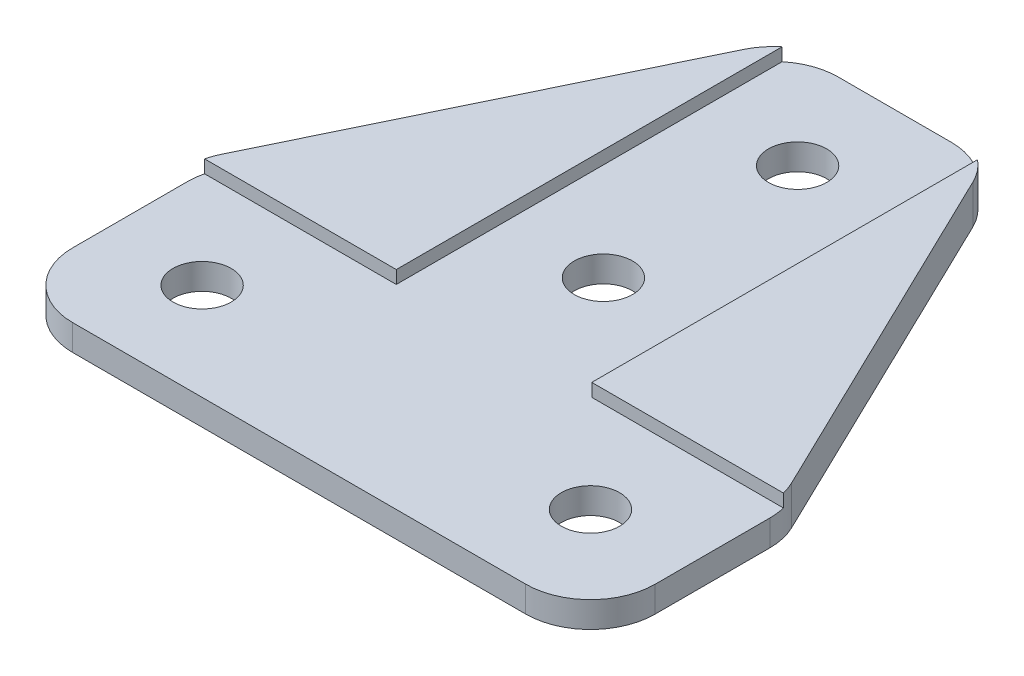
ISO-10303-21;
HEADER;
FILE_DESCRIPTION(('STEP AP214'),'2;1');
FILE_NAME('part.step','',(''),(''),'','','');
FILE_SCHEMA(('AUTOMOTIVE_DESIGN { 1 0 10303 214 1 1 1 1 }'));
ENDSEC;
DATA;
#1=APPLICATION_CONTEXT('core data for automotive mechanical design processes');
#2=APPLICATION_PROTOCOL_DEFINITION('international standard','automotive_design',2000,#1);
#3=PRODUCT_CONTEXT('',#1,'mechanical');
#4=PRODUCT('Part','Part','',(#3));
#5=PRODUCT_RELATED_PRODUCT_CATEGORY('part','',(#4));
#6=PRODUCT_DEFINITION_FORMATION('','',#4);
#7=PRODUCT_DEFINITION_CONTEXT('part definition',#1,'design');
#8=PRODUCT_DEFINITION('design','',#6,#7);
#9=PRODUCT_DEFINITION_SHAPE('','',#8);
#10=(LENGTH_UNIT() NAMED_UNIT(*) SI_UNIT(.MILLI.,.METRE.));
#11=(NAMED_UNIT(*) PLANE_ANGLE_UNIT() SI_UNIT($,.RADIAN.));
#12=(NAMED_UNIT(*) SI_UNIT($,.STERADIAN.) SOLID_ANGLE_UNIT());
#13=UNCERTAINTY_MEASURE_WITH_UNIT(LENGTH_MEASURE(1.E-05),#10,'distance_accuracy_value','');
#14=(GEOMETRIC_REPRESENTATION_CONTEXT(3) GLOBAL_UNCERTAINTY_ASSIGNED_CONTEXT((#13)) GLOBAL_UNIT_ASSIGNED_CONTEXT((#10,
#11,#12)) REPRESENTATION_CONTEXT('',''));
#15=CARTESIAN_POINT('',(0.,0.,0.));
#16=DIRECTION('',(0.,0.,1.));
#17=DIRECTION('',(1.,0.,0.));
#18=AXIS2_PLACEMENT_3D('',#15,#16,#17);
#19=CARTESIAN_POINT('',(0.,3.,-15.));
#20=DIRECTION('',(1.,0.,0.));
#21=DIRECTION('',(0.,0.,-1.));
#22=AXIS2_PLACEMENT_3D('',#19,#20,#21);
#23=PLANE('',#22);
#24=DIRECTION('',(0.,0.,1.));
#25=VECTOR('',#24,1.);
#26=CARTESIAN_POINT('',(0.,2.,0.));
#27=LINE('',#26,#25);
#28=CARTESIAN_POINT('',(0.,2.,-13.8538830948516));
#29=VERTEX_POINT('',#28);
#30=CARTESIAN_POINT('',(0.,2.,-5.));
#31=VERTEX_POINT('',#30);
#32=EDGE_CURVE('E54',#29,#31,#27,.T.);
#33=ORIENTED_EDGE('',*,*,#32,.F.);
#34=DIRECTION('',(0.,-1.,0.));
#35=VECTOR('',#34,1.);
#36=CARTESIAN_POINT('',(0.,3.,-13.8538830948516));
#37=LINE('',#36,#35);
#38=CARTESIAN_POINT('',(0.,0.,-13.8538830948516));
#39=VERTEX_POINT('',#38);
#40=EDGE_CURVE('E318',#29,#39,#37,.T.);
#41=ORIENTED_EDGE('',*,*,#40,.T.);
#42=DIRECTION('',(0.,0.,1.));
#43=VECTOR('',#42,1.);
#44=CARTESIAN_POINT('',(0.,0.,-15.));
#45=LINE('',#44,#43);
#46=CARTESIAN_POINT('',(0.,0.,-5.));
#47=VERTEX_POINT('',#46);
#48=EDGE_CURVE('E239',#39,#47,#45,.T.);
#49=ORIENTED_EDGE('',*,*,#48,.T.);
#50=DIRECTION('',(0.,-1.,0.));
#51=VECTOR('',#50,1.);
#52=CARTESIAN_POINT('',(0.,3.,-5.));
#53=LINE('',#52,#51);
#54=EDGE_CURVE('E315',#47,#31,#53,.F.);
#55=ORIENTED_EDGE('',*,*,#54,.T.);
#56=EDGE_LOOP('',(#33,#41,#49,#55));
#57=FACE_BOUND('',#56,.T.);
#58=ADVANCED_FACE('F39',(#57),#23,.F.);
#59=CARTESIAN_POINT('',(0.,3.,0.));
#60=DIRECTION('',(0.,0.,-1.));
#61=DIRECTION('',(-1.,0.,0.));
#62=AXIS2_PLACEMENT_3D('',#59,#60,#61);
#63=PLANE('',#62);
#64=DIRECTION('',(1.,0.,0.));
#65=VECTOR('',#64,1.);
#66=CARTESIAN_POINT('',(0.,2.,0.));
#67=LINE('',#66,#65);
#68=CARTESIAN_POINT('',(5.,2.,0.));
#69=VERTEX_POINT('',#68);
#70=CARTESIAN_POINT('',(40.,2.,0.));
#71=VERTEX_POINT('',#70);
#72=EDGE_CURVE('E191',#69,#71,#67,.T.);
#73=ORIENTED_EDGE('',*,*,#72,.F.);
#74=DIRECTION('',(0.,-1.,0.));
#75=VECTOR('',#74,1.);
#76=CARTESIAN_POINT('',(5.,3.,0.));
#77=LINE('',#76,#75);
#78=CARTESIAN_POINT('',(5.,0.,0.));
#79=VERTEX_POINT('',#78);
#80=EDGE_CURVE('E310',#69,#79,#77,.T.);
#81=ORIENTED_EDGE('',*,*,#80,.T.);
#82=DIRECTION('',(1.,0.,0.));
#83=VECTOR('',#82,1.);
#84=CARTESIAN_POINT('',(0.,0.,0.));
#85=LINE('',#84,#83);
#86=CARTESIAN_POINT('',(40.,0.,0.));
#87=VERTEX_POINT('',#86);
#88=EDGE_CURVE('E257',#79,#87,#85,.T.);
#89=ORIENTED_EDGE('',*,*,#88,.T.);
#90=DIRECTION('',(0.,-1.,0.));
#91=VECTOR('',#90,1.);
#92=CARTESIAN_POINT('',(40.,3.,0.));
#93=LINE('',#92,#91);
#94=EDGE_CURVE('E312',#87,#71,#93,.F.);
#95=ORIENTED_EDGE('',*,*,#94,.T.);
#96=EDGE_LOOP('',(#73,#81,#89,#95));
#97=FACE_BOUND('',#96,.T.);
#98=ADVANCED_FACE('F350',(#97),#63,.F.);
#99=CARTESIAN_POINT('',(45.,3.,0.));
#100=DIRECTION('',(-1.,0.,0.));
#101=DIRECTION('',(0.,0.,1.));
#102=AXIS2_PLACEMENT_3D('',#99,#100,#101);
#103=PLANE('',#102);
#104=DIRECTION('',(0.,0.,-1.));
#105=VECTOR('',#104,1.);
#106=CARTESIAN_POINT('',(45.,2.,0.));
#107=LINE('',#106,#105);
#108=CARTESIAN_POINT('',(45.,2.,-5.));
#109=VERTEX_POINT('',#108);
#110=CARTESIAN_POINT('',(45.,2.,-13.8538830948516));
#111=VERTEX_POINT('',#110);
#112=EDGE_CURVE('E195',#109,#111,#107,.T.);
#113=ORIENTED_EDGE('',*,*,#112,.F.);
#114=DIRECTION('',(0.,-1.,0.));
#115=VECTOR('',#114,1.);
#116=CARTESIAN_POINT('',(45.,3.,-5.));
#117=LINE('',#116,#115);
#118=CARTESIAN_POINT('',(45.,0.,-5.));
#119=VERTEX_POINT('',#118);
#120=EDGE_CURVE('E305',#109,#119,#117,.T.);
#121=ORIENTED_EDGE('',*,*,#120,.T.);
#122=DIRECTION('',(0.,0.,-1.));
#123=VECTOR('',#122,1.);
#124=CARTESIAN_POINT('',(45.,0.,0.));
#125=LINE('',#124,#123);
#126=CARTESIAN_POINT('',(45.,0.,-13.8538830948516));
#127=VERTEX_POINT('',#126);
#128=EDGE_CURVE('E260',#119,#127,#125,.T.);
#129=ORIENTED_EDGE('',*,*,#128,.T.);
#130=DIRECTION('',(0.,-1.,0.));
#131=VECTOR('',#130,1.);
#132=CARTESIAN_POINT('',(45.,3.,-13.8538830948516));
#133=LINE('',#132,#131);
#134=EDGE_CURVE('E307',#127,#111,#133,.F.);
#135=ORIENTED_EDGE('',*,*,#134,.T.);
#136=EDGE_LOOP('',(#113,#121,#129,#135));
#137=FACE_BOUND('',#136,.T.);
#138=ADVANCED_FACE('F359',(#137),#103,.F.);
#139=CARTESIAN_POINT('',(30.,3.,-46.));
#140=DIRECTION('',(0.,0.,1.));
#141=DIRECTION('',(1.,0.,0.));
#142=AXIS2_PLACEMENT_3D('',#139,#140,#141);
#143=PLANE('',#142);
#144=DIRECTION('',(-1.,0.,0.));
#145=VECTOR('',#144,1.);
#146=CARTESIAN_POINT('',(14.95,2.,-46.));
#147=LINE('',#146,#145);
#148=CARTESIAN_POINT('',(26.8647821426701,2.,-46.));
#149=VERTEX_POINT('',#148);
#150=CARTESIAN_POINT('',(18.1352178573299,2.,-46.));
#151=VERTEX_POINT('',#150);
#152=EDGE_CURVE('E185',#149,#151,#147,.T.);
#153=ORIENTED_EDGE('',*,*,#152,.F.);
#154=DIRECTION('',(0.,-1.,0.));
#155=VECTOR('',#154,1.);
#156=CARTESIAN_POINT('',(26.8647821426701,3.,-46.));
#157=LINE('',#156,#155);
#158=CARTESIAN_POINT('',(26.8647821426701,0.,-46.));
#159=VERTEX_POINT('',#158);
#160=EDGE_CURVE('E272',#149,#159,#157,.T.);
#161=ORIENTED_EDGE('',*,*,#160,.T.);
#162=DIRECTION('',(-1.,0.,0.));
#163=VECTOR('',#162,1.);
#164=CARTESIAN_POINT('',(30.,0.,-46.));
#165=LINE('',#164,#163);
#166=CARTESIAN_POINT('',(18.1352178573299,0.,-46.));
#167=VERTEX_POINT('',#166);
#168=EDGE_CURVE('E266',#159,#167,#165,.T.);
#169=ORIENTED_EDGE('',*,*,#168,.T.);
#170=DIRECTION('',(0.,-1.,0.));
#171=VECTOR('',#170,1.);
#172=CARTESIAN_POINT('',(18.1352178573299,3.,-46.));
#173=LINE('',#172,#171);
#174=EDGE_CURVE('E254',#167,#151,#173,.F.);
#175=ORIENTED_EDGE('',*,*,#174,.T.);
#176=EDGE_LOOP('',(#153,#161,#169,#175));
#177=FACE_BOUND('',#176,.T.);
#178=ADVANCED_FACE('F384',(#177),#143,.F.);
#179=CARTESIAN_POINT('',(0.,3.,0.));
#180=DIRECTION('',(0.,1.,0.));
#181=DIRECTION('',(0.,0.,1.));
#182=AXIS2_PLACEMENT_3D('',#179,#180,#181);
#183=PLANE('',#182);
#184=DIRECTION('',(0.,0.,-1.));
#185=VECTOR('',#184,1.);
#186=CARTESIAN_POINT('',(30.05,3.,-46.));
#187=LINE('',#186,#185);
#188=CARTESIAN_POINT('',(30.05,3.,-15.05));
#189=VERTEX_POINT('',#188);
#190=CARTESIAN_POINT('',(30.05,3.,-44.8541389701653));
#191=VERTEX_POINT('',#190);
#192=EDGE_CURVE('E175',#189,#191,#187,.T.);
#193=ORIENTED_EDGE('',*,*,#192,.F.);
#194=DIRECTION('',(-1.,0.,0.));
#195=VECTOR('',#194,1.);
#196=CARTESIAN_POINT('',(30.05,3.,-15.05));
#197=LINE('',#196,#195);
#198=CARTESIAN_POINT('',(44.854822792772,3.,-15.05));
#199=VERTEX_POINT('',#198);
#200=EDGE_CURVE('E206',#199,#189,#197,.T.);
#201=ORIENTED_EDGE('',*,*,#200,.F.);
#202=CARTESIAN_POINT('',(40.,3.,-13.8538830948516));
#203=DIRECTION('',(0.,1.,0.));
#204=DIRECTION('',(0.,0.,1.));
#205=AXIS2_PLACEMENT_3D('',#202,#203,#204);
#206=CIRCLE('',#205,5.);
#207=CARTESIAN_POINT('',(44.5007962570776,3.,-16.031687735373));
#208=VERTEX_POINT('',#207);
#209=EDGE_CURVE('E294',#199,#208,#206,.T.);
#210=ORIENTED_EDGE('',*,*,#209,.T.);
#211=DIRECTION('',(-0.435560928104281,0.,-0.900159251415514));
#212=VECTOR('',#211,1.);
#213=CARTESIAN_POINT('',(45.,3.,-15.));
#214=LINE('',#213,#212);
#215=CARTESIAN_POINT('',(31.3655783997477,3.,-43.1778046405214));
#216=VERTEX_POINT('',#215);
#217=EDGE_CURVE('E248',#208,#216,#214,.T.);
#218=ORIENTED_EDGE('',*,*,#217,.T.);
#219=CARTESIAN_POINT('',(26.8647821426701,3.,-41.));
#220=DIRECTION('',(0.,1.,0.));
#221=DIRECTION('',(0.,0.,1.));
#222=AXIS2_PLACEMENT_3D('',#219,#220,#221);
#223=CIRCLE('',#222,5.);
#224=EDGE_CURVE('E298',#216,#191,#223,.T.);
#225=ORIENTED_EDGE('',*,*,#224,.T.);
#226=EDGE_LOOP('',(#193,#201,#210,#218,#225));
#227=FACE_BOUND('',#226,.T.);
#228=ADVANCED_FACE('F390',(#227),#183,.T.);
#229=CARTESIAN_POINT('',(37.5,0.,-7.5));
#230=DIRECTION('',(0.,1.,0.));
#231=DIRECTION('',(0.,0.,1.));
#232=AXIS2_PLACEMENT_3D('',#229,#230,#231);
#233=CYLINDRICAL_SURFACE('',#232,2.25);
#234=CARTESIAN_POINT('',(37.5,0.,-7.5));
#235=DIRECTION('',(0.,1.,0.));
#236=DIRECTION('',(0.,0.,1.));
#237=AXIS2_PLACEMENT_3D('',#234,#235,#236);
#238=CIRCLE('',#237,2.25);
#239=CARTESIAN_POINT('',(37.5,0.,-5.25));
#240=VERTEX_POINT('',#239);
#241=EDGE_CURVE('E235',#240,#240,#238,.T.);
#242=ORIENTED_EDGE('',*,*,#241,.F.);
#243=EDGE_LOOP('',(#242));
#244=FACE_BOUND('',#243,.T.);
#245=CARTESIAN_POINT('',(37.5,2.,-7.5));
#246=DIRECTION('',(0.,1.,0.));
#247=DIRECTION('',(0.,0.,1.));
#248=AXIS2_PLACEMENT_3D('',#245,#246,#247);
#249=CIRCLE('',#248,2.25);
#250=CARTESIAN_POINT('',(37.5,2.,-5.25));
#251=VERTEX_POINT('',#250);
#252=EDGE_CURVE('E232',#251,#251,#249,.F.);
#253=ORIENTED_EDGE('',*,*,#252,.F.);
#254=EDGE_LOOP('',(#253));
#255=FACE_BOUND('',#254,.T.);
#256=ADVANCED_FACE('F392',(#244,#255),#233,.F.);
#257=CARTESIAN_POINT('',(22.5,0.,-23.5));
#258=DIRECTION('',(0.,1.,0.));
#259=DIRECTION('',(0.,0.,1.));
#260=AXIS2_PLACEMENT_3D('',#257,#258,#259);
#261=CYLINDRICAL_SURFACE('',#260,2.25);
#262=CARTESIAN_POINT('',(22.5,0.,-23.5));
#263=DIRECTION('',(0.,1.,0.));
#264=DIRECTION('',(0.,0.,1.));
#265=AXIS2_PLACEMENT_3D('',#262,#263,#264);
#266=CIRCLE('',#265,2.25);
#267=CARTESIAN_POINT('',(22.5,0.,-21.25));
#268=VERTEX_POINT('',#267);
#269=EDGE_CURVE('E243',#268,#268,#266,.T.);
#270=ORIENTED_EDGE('',*,*,#269,.F.);
#271=EDGE_LOOP('',(#270));
#272=FACE_BOUND('',#271,.T.);
#273=CARTESIAN_POINT('',(22.5,2.,-23.5));
#274=DIRECTION('',(0.,1.,0.));
#275=DIRECTION('',(0.,0.,1.));
#276=AXIS2_PLACEMENT_3D('',#273,#274,#275);
#277=CIRCLE('',#276,2.25);
#278=CARTESIAN_POINT('',(22.5,2.,-21.25));
#279=VERTEX_POINT('',#278);
#280=EDGE_CURVE('E229',#279,#279,#277,.F.);
#281=ORIENTED_EDGE('',*,*,#280,.F.);
#282=EDGE_LOOP('',(#281));
#283=FACE_BOUND('',#282,.T.);
#284=ADVANCED_FACE('F398',(#272,#283),#261,.F.);
#285=CARTESIAN_POINT('',(22.5,0.,-38.5));
#286=DIRECTION('',(0.,1.,0.));
#287=DIRECTION('',(0.,0.,1.));
#288=AXIS2_PLACEMENT_3D('',#285,#286,#287);
#289=CYLINDRICAL_SURFACE('',#288,2.25);
#290=CARTESIAN_POINT('',(22.5,0.,-38.5));
#291=DIRECTION('',(0.,1.,0.));
#292=DIRECTION('',(0.,0.,1.));
#293=AXIS2_PLACEMENT_3D('',#290,#291,#292);
#294=CIRCLE('',#293,2.25);
#295=CARTESIAN_POINT('',(22.5,0.,-36.25));
#296=VERTEX_POINT('',#295);
#297=EDGE_CURVE('E240',#296,#296,#294,.T.);
#298=ORIENTED_EDGE('',*,*,#297,.F.);
#299=EDGE_LOOP('',(#298));
#300=FACE_BOUND('',#299,.T.);
#301=CARTESIAN_POINT('',(22.5,2.,-38.5));
#302=DIRECTION('',(0.,1.,0.));
#303=DIRECTION('',(0.,0.,1.));
#304=AXIS2_PLACEMENT_3D('',#301,#302,#303);
#305=CIRCLE('',#304,2.25);
#306=CARTESIAN_POINT('',(22.5,2.,-36.25));
#307=VERTEX_POINT('',#306);
#308=EDGE_CURVE('E226',#307,#307,#305,.F.);
#309=ORIENTED_EDGE('',*,*,#308,.F.);
#310=EDGE_LOOP('',(#309));
#311=FACE_BOUND('',#310,.T.);
#312=ADVANCED_FACE('F439',(#300,#311),#289,.F.);
#313=CARTESIAN_POINT('',(7.5,0.,-7.5));
#314=DIRECTION('',(0.,1.,0.));
#315=DIRECTION('',(0.,0.,1.));
#316=AXIS2_PLACEMENT_3D('',#313,#314,#315);
#317=CYLINDRICAL_SURFACE('',#316,2.25);
#318=CARTESIAN_POINT('',(7.5,0.,-7.5));
#319=DIRECTION('',(0.,1.,0.));
#320=DIRECTION('',(0.,0.,1.));
#321=AXIS2_PLACEMENT_3D('',#318,#319,#320);
#322=CIRCLE('',#321,2.25);
#323=CARTESIAN_POINT('',(7.5,0.,-5.25));
#324=VERTEX_POINT('',#323);
#325=EDGE_CURVE('E236',#324,#324,#322,.T.);
#326=ORIENTED_EDGE('',*,*,#325,.F.);
#327=EDGE_LOOP('',(#326));
#328=FACE_BOUND('',#327,.T.);
#329=CARTESIAN_POINT('',(7.5,2.,-7.5));
#330=DIRECTION('',(0.,1.,0.));
#331=DIRECTION('',(0.,0.,1.));
#332=AXIS2_PLACEMENT_3D('',#329,#330,#331);
#333=CIRCLE('',#332,2.25);
#334=CARTESIAN_POINT('',(7.5,2.,-5.25));
#335=VERTEX_POINT('',#334);
#336=EDGE_CURVE('E223',#335,#335,#333,.F.);
#337=ORIENTED_EDGE('',*,*,#336,.F.);
#338=EDGE_LOOP('',(#337));
#339=FACE_BOUND('',#338,.T.);
#340=ADVANCED_FACE('F420',(#328,#339),#317,.F.);
#341=CARTESIAN_POINT('',(40.,3.,-5.));
#342=DIRECTION('',(0.,-1.,0.));
#343=DIRECTION('',(0.,0.,-1.));
#344=AXIS2_PLACEMENT_3D('',#341,#342,#343);
#345=CYLINDRICAL_SURFACE('',#344,5.);
#346=ORIENTED_EDGE('',*,*,#120,.F.);
#347=CARTESIAN_POINT('',(40.,2.,-5.));
#348=DIRECTION('',(0.,1.,0.));
#349=DIRECTION('',(0.,0.,1.));
#350=AXIS2_PLACEMENT_3D('',#347,#348,#349);
#351=CIRCLE('',#350,5.);
#352=EDGE_CURVE('E213',#109,#71,#351,.F.);
#353=ORIENTED_EDGE('',*,*,#352,.T.);
#354=ORIENTED_EDGE('',*,*,#94,.F.);
#355=CARTESIAN_POINT('',(40.,0.,-5.));
#356=DIRECTION('',(0.,1.,0.));
#357=DIRECTION('',(0.,0.,1.));
#358=AXIS2_PLACEMENT_3D('',#355,#356,#357);
#359=CIRCLE('',#358,5.);
#360=EDGE_CURVE('E278',#119,#87,#359,.F.);
#361=ORIENTED_EDGE('',*,*,#360,.F.);
#362=EDGE_LOOP('',(#346,#353,#354,#361));
#363=FACE_BOUND('',#362,.T.);
#364=ADVANCED_FACE('F355',(#363),#345,.T.);
#365=CARTESIAN_POINT('',(5.,3.,-5.));
#366=DIRECTION('',(0.,-1.,0.));
#367=DIRECTION('',(0.,0.,-1.));
#368=AXIS2_PLACEMENT_3D('',#365,#366,#367);
#369=CYLINDRICAL_SURFACE('',#368,5.);
#370=ORIENTED_EDGE('',*,*,#80,.F.);
#371=CARTESIAN_POINT('',(5.,2.,-5.));
#372=DIRECTION('',(0.,1.,0.));
#373=DIRECTION('',(0.,0.,1.));
#374=AXIS2_PLACEMENT_3D('',#371,#372,#373);
#375=CIRCLE('',#374,5.);
#376=EDGE_CURVE('E320',#69,#31,#375,.F.);
#377=ORIENTED_EDGE('',*,*,#376,.T.);
#378=ORIENTED_EDGE('',*,*,#54,.F.);
#379=CARTESIAN_POINT('',(5.,0.,-5.));
#380=DIRECTION('',(0.,1.,0.));
#381=DIRECTION('',(0.,0.,1.));
#382=AXIS2_PLACEMENT_3D('',#379,#380,#381);
#383=CIRCLE('',#382,5.);
#384=EDGE_CURVE('E274',#79,#47,#383,.F.);
#385=ORIENTED_EDGE('',*,*,#384,.F.);
#386=EDGE_LOOP('',(#370,#377,#378,#385));
#387=FACE_BOUND('',#386,.T.);
#388=ADVANCED_FACE('F41',(#387),#369,.T.);
#389=CARTESIAN_POINT('',(45.,3.,-15.));
#390=DIRECTION('',(-0.900159251415513,0.,0.435560928104281));
#391=DIRECTION('',(0.435560928104281,0.,0.900159251415513));
#392=AXIS2_PLACEMENT_3D('',#389,#390,#391);
#393=PLANE('',#392);
#394=DIRECTION('',(-0.435560928104281,0.,-0.900159251415514));
#395=VECTOR('',#394,1.);
#396=CARTESIAN_POINT('',(45.,0.,-15.));
#397=LINE('',#396,#395);
#398=CARTESIAN_POINT('',(44.5007962570776,0.,-16.031687735373));
#399=VERTEX_POINT('',#398);
#400=CARTESIAN_POINT('',(31.3655783997477,0.,-43.1778046405214));
#401=VERTEX_POINT('',#400);
#402=EDGE_CURVE('E263',#399,#401,#397,.T.);
#403=ORIENTED_EDGE('',*,*,#402,.T.);
#404=DIRECTION('',(0.,-1.,0.));
#405=VECTOR('',#404,1.);
#406=CARTESIAN_POINT('',(31.3655783997477,3.,-43.1778046405214));
#407=LINE('',#406,#405);
#408=EDGE_CURVE('E289',#401,#216,#407,.F.);
#409=ORIENTED_EDGE('',*,*,#408,.T.);
#410=ORIENTED_EDGE('',*,*,#217,.F.);
#411=DIRECTION('',(0.,-1.,0.));
#412=VECTOR('',#411,1.);
#413=CARTESIAN_POINT('',(44.5007962570776,3.,-16.031687735373));
#414=LINE('',#413,#412);
#415=EDGE_CURVE('E286',#208,#399,#414,.T.);
#416=ORIENTED_EDGE('',*,*,#415,.T.);
#417=EDGE_LOOP('',(#403,#409,#410,#416));
#418=FACE_BOUND('',#417,.T.);
#419=ADVANCED_FACE('F387',(#418),#393,.F.);
#420=CARTESIAN_POINT('',(15.,3.,-46.));
#421=DIRECTION('',(0.900159251415513,0.,0.43556092810428));
#422=DIRECTION('',(0.435560928104281,0.,-0.900159251415514));
#423=AXIS2_PLACEMENT_3D('',#420,#421,#422);
#424=PLANE('',#423);
#425=DIRECTION('',(-0.435560928104281,0.,0.900159251415514));
#426=VECTOR('',#425,1.);
#427=CARTESIAN_POINT('',(15.,3.,-46.));
#428=LINE('',#427,#426);
#429=CARTESIAN_POINT('',(13.6344216002523,3.,-43.1778046405214));
#430=VERTEX_POINT('',#429);
#431=CARTESIAN_POINT('',(0.499203742922432,3.,-16.031687735373));
#432=VERTEX_POINT('',#431);
#433=EDGE_CURVE('E251',#430,#432,#428,.T.);
#434=ORIENTED_EDGE('',*,*,#433,.F.);
#435=DIRECTION('',(0.,-1.,0.));
#436=VECTOR('',#435,1.);
#437=CARTESIAN_POINT('',(13.6344216002523,3.,-43.1778046405214));
#438=LINE('',#437,#436);
#439=CARTESIAN_POINT('',(13.6344216002523,0.,-43.1778046405214));
#440=VERTEX_POINT('',#439);
#441=EDGE_CURVE('E302',#430,#440,#438,.T.);
#442=ORIENTED_EDGE('',*,*,#441,.T.);
#443=DIRECTION('',(-0.435560928104281,0.,0.900159251415514));
#444=VECTOR('',#443,1.);
#445=CARTESIAN_POINT('',(15.,0.,-46.));
#446=LINE('',#445,#444);
#447=CARTESIAN_POINT('',(0.499203742922432,0.,-16.031687735373));
#448=VERTEX_POINT('',#447);
#449=EDGE_CURVE('E252',#440,#448,#446,.T.);
#450=ORIENTED_EDGE('',*,*,#449,.T.);
#451=DIRECTION('',(0.,-1.,0.));
#452=VECTOR('',#451,1.);
#453=CARTESIAN_POINT('',(0.49920374292243,3.,-16.031687735373));
#454=LINE('',#453,#452);
#455=EDGE_CURVE('E62',#448,#432,#454,.F.);
#456=ORIENTED_EDGE('',*,*,#455,.T.);
#457=EDGE_LOOP('',(#434,#442,#450,#456));
#458=FACE_BOUND('',#457,.T.);
#459=ADVANCED_FACE('F332',(#458),#424,.F.);
#460=DIRECTION('',(0.,0.,1.));
#461=VECTOR('',#460,1.);
#462=CARTESIAN_POINT('',(14.95,3.,-46.));
#463=LINE('',#462,#461);
#464=CARTESIAN_POINT('',(14.95,3.,-44.8541389701653));
#465=VERTEX_POINT('',#464);
#466=CARTESIAN_POINT('',(14.95,3.,-15.05));
#467=VERTEX_POINT('',#466);
#468=EDGE_CURVE('E181',#465,#467,#463,.T.);
#469=ORIENTED_EDGE('',*,*,#468,.F.);
#470=CARTESIAN_POINT('',(18.1352178573299,3.,-41.));
#471=DIRECTION('',(0.,1.,0.));
#472=DIRECTION('',(0.,0.,1.));
#473=AXIS2_PLACEMENT_3D('',#470,#471,#472);
#474=CIRCLE('',#473,5.);
#475=EDGE_CURVE('E296',#465,#430,#474,.T.);
#476=ORIENTED_EDGE('',*,*,#475,.T.);
#477=ORIENTED_EDGE('',*,*,#433,.T.);
#478=CARTESIAN_POINT('',(5.,3.,-13.8538830948516));
#479=DIRECTION('',(0.,1.,0.));
#480=DIRECTION('',(0.,0.,1.));
#481=AXIS2_PLACEMENT_3D('',#478,#479,#480);
#482=CIRCLE('',#481,5.);
#483=CARTESIAN_POINT('',(0.145177207228026,3.,-15.05));
#484=VERTEX_POINT('',#483);
#485=EDGE_CURVE('E291',#432,#484,#482,.T.);
#486=ORIENTED_EDGE('',*,*,#485,.T.);
#487=DIRECTION('',(-1.,0.,0.));
#488=VECTOR('',#487,1.);
#489=CARTESIAN_POINT('',(0.,3.,-15.05));
#490=LINE('',#489,#488);
#491=EDGE_CURVE('E204',#467,#484,#490,.T.);
#492=ORIENTED_EDGE('',*,*,#491,.F.);
#493=EDGE_LOOP('',(#469,#476,#477,#486,#492));
#494=FACE_BOUND('',#493,.T.);
#495=ADVANCED_FACE('F327',(#494),#183,.T.);
#496=CARTESIAN_POINT('',(0.,0.,0.));
#497=DIRECTION('',(0.,1.,0.));
#498=DIRECTION('',(0.,0.,1.));
#499=AXIS2_PLACEMENT_3D('',#496,#497,#498);
#500=PLANE('',#499);
#501=ORIENTED_EDGE('',*,*,#325,.T.);
#502=EDGE_LOOP('',(#501));
#503=FACE_BOUND('',#502,.T.);
#504=ORIENTED_EDGE('',*,*,#297,.T.);
#505=EDGE_LOOP('',(#504));
#506=FACE_BOUND('',#505,.T.);
#507=ORIENTED_EDGE('',*,*,#269,.T.);
#508=EDGE_LOOP('',(#507));
#509=FACE_BOUND('',#508,.T.);
#510=ORIENTED_EDGE('',*,*,#241,.T.);
#511=EDGE_LOOP('',(#510));
#512=FACE_BOUND('',#511,.T.);
#513=ORIENTED_EDGE('',*,*,#168,.F.);
#514=CARTESIAN_POINT('',(26.8647821426701,0.,-41.));
#515=DIRECTION('',(0.,1.,0.));
#516=DIRECTION('',(0.,0.,1.));
#517=AXIS2_PLACEMENT_3D('',#514,#515,#516);
#518=CIRCLE('',#517,5.);
#519=EDGE_CURVE('E284',#159,#401,#518,.F.);
#520=ORIENTED_EDGE('',*,*,#519,.T.);
#521=ORIENTED_EDGE('',*,*,#402,.F.);
#522=CARTESIAN_POINT('',(40.,0.,-13.8538830948516));
#523=DIRECTION('',(0.,1.,0.));
#524=DIRECTION('',(0.,0.,1.));
#525=AXIS2_PLACEMENT_3D('',#522,#523,#524);
#526=CIRCLE('',#525,5.);
#527=EDGE_CURVE('E280',#399,#127,#526,.F.);
#528=ORIENTED_EDGE('',*,*,#527,.T.);
#529=ORIENTED_EDGE('',*,*,#128,.F.);
#530=ORIENTED_EDGE('',*,*,#360,.T.);
#531=ORIENTED_EDGE('',*,*,#88,.F.);
#532=ORIENTED_EDGE('',*,*,#384,.T.);
#533=ORIENTED_EDGE('',*,*,#48,.F.);
#534=CARTESIAN_POINT('',(5.,0.,-13.8538830948516));
#535=DIRECTION('',(0.,1.,0.));
#536=DIRECTION('',(0.,0.,1.));
#537=AXIS2_PLACEMENT_3D('',#534,#535,#536);
#538=CIRCLE('',#537,5.);
#539=EDGE_CURVE('E276',#39,#448,#538,.F.);
#540=ORIENTED_EDGE('',*,*,#539,.T.);
#541=ORIENTED_EDGE('',*,*,#449,.F.);
#542=CARTESIAN_POINT('',(18.1352178573299,0.,-41.));
#543=DIRECTION('',(0.,1.,0.));
#544=DIRECTION('',(0.,0.,1.));
#545=AXIS2_PLACEMENT_3D('',#542,#543,#544);
#546=CIRCLE('',#545,5.);
#547=EDGE_CURVE('E282',#440,#167,#546,.F.);
#548=ORIENTED_EDGE('',*,*,#547,.T.);
#549=EDGE_LOOP('',(#513,#520,#521,#528,#529,#530,#531,#532,#533,#540,#541,#548));
#550=FACE_BOUND('',#549,.T.);
#551=ADVANCED_FACE('F335',(#503,#506,#509,#512,#550),#500,.F.);
#552=CARTESIAN_POINT('',(26.8647821426701,3.,-41.));
#553=DIRECTION('',(0.,-1.,0.));
#554=DIRECTION('',(0.,0.,-1.));
#555=AXIS2_PLACEMENT_3D('',#552,#553,#554);
#556=CYLINDRICAL_SURFACE('',#555,5.);
#557=DIRECTION('',(0.,-1.,0.));
#558=VECTOR('',#557,1.);
#559=CARTESIAN_POINT('',(30.05,3.,-44.8541389701653));
#560=LINE('',#559,#558);
#561=CARTESIAN_POINT('',(30.05,2.,-44.8541389701653));
#562=VERTEX_POINT('',#561);
#563=EDGE_CURVE('E11',#191,#562,#560,.T.);
#564=ORIENTED_EDGE('',*,*,#563,.F.);
#565=ORIENTED_EDGE('',*,*,#224,.F.);
#566=ORIENTED_EDGE('',*,*,#408,.F.);
#567=ORIENTED_EDGE('',*,*,#519,.F.);
#568=ORIENTED_EDGE('',*,*,#160,.F.);
#569=CARTESIAN_POINT('',(26.8647821426701,2.,-41.));
#570=DIRECTION('',(0.,1.,0.));
#571=DIRECTION('',(0.,0.,1.));
#572=AXIS2_PLACEMENT_3D('',#569,#570,#571);
#573=CIRCLE('',#572,5.);
#574=EDGE_CURVE('E220',#149,#562,#573,.F.);
#575=ORIENTED_EDGE('',*,*,#574,.T.);
#576=EDGE_LOOP('',(#564,#565,#566,#567,#568,#575));
#577=FACE_BOUND('',#576,.T.);
#578=ADVANCED_FACE('F379',(#577),#556,.T.);
#579=CARTESIAN_POINT('',(18.1352178573299,3.,-41.));
#580=DIRECTION('',(0.,-1.,0.));
#581=DIRECTION('',(0.,0.,-1.));
#582=AXIS2_PLACEMENT_3D('',#579,#580,#581);
#583=CYLINDRICAL_SURFACE('',#582,5.);
#584=DIRECTION('',(0.,-1.,0.));
#585=VECTOR('',#584,1.);
#586=CARTESIAN_POINT('',(14.95,3.,-44.8541389701653));
#587=LINE('',#586,#585);
#588=CARTESIAN_POINT('',(14.95,2.,-44.8541389701653));
#589=VERTEX_POINT('',#588);
#590=EDGE_CURVE('E47',#589,#465,#587,.F.);
#591=ORIENTED_EDGE('',*,*,#590,.F.);
#592=CARTESIAN_POINT('',(18.1352178573299,2.,-41.));
#593=DIRECTION('',(0.,1.,0.));
#594=DIRECTION('',(0.,0.,1.));
#595=AXIS2_PLACEMENT_3D('',#592,#593,#594);
#596=CIRCLE('',#595,5.);
#597=EDGE_CURVE('E172',#589,#151,#596,.F.);
#598=ORIENTED_EDGE('',*,*,#597,.T.);
#599=ORIENTED_EDGE('',*,*,#174,.F.);
#600=ORIENTED_EDGE('',*,*,#547,.F.);
#601=ORIENTED_EDGE('',*,*,#441,.F.);
#602=ORIENTED_EDGE('',*,*,#475,.F.);
#603=EDGE_LOOP('',(#591,#598,#599,#600,#601,#602));
#604=FACE_BOUND('',#603,.T.);
#605=ADVANCED_FACE('F329',(#604),#583,.T.);
#606=CARTESIAN_POINT('',(40.,3.,-13.8538830948516));
#607=DIRECTION('',(0.,-1.,0.));
#608=DIRECTION('',(0.,0.,-1.));
#609=AXIS2_PLACEMENT_3D('',#606,#607,#608);
#610=CYLINDRICAL_SURFACE('',#609,5.);
#611=DIRECTION('',(0.,-1.,0.));
#612=VECTOR('',#611,1.);
#613=CARTESIAN_POINT('',(44.854822792772,3.,-15.05));
#614=LINE('',#613,#612);
#615=CARTESIAN_POINT('',(44.854822792772,2.,-15.05));
#616=VERTEX_POINT('',#615);
#617=EDGE_CURVE('E323',#616,#199,#614,.F.);
#618=ORIENTED_EDGE('',*,*,#617,.F.);
#619=CARTESIAN_POINT('',(40.,2.,-13.8538830948516));
#620=DIRECTION('',(0.,1.,0.));
#621=DIRECTION('',(0.,0.,1.));
#622=AXIS2_PLACEMENT_3D('',#619,#620,#621);
#623=CIRCLE('',#622,5.);
#624=EDGE_CURVE('E216',#616,#111,#623,.F.);
#625=ORIENTED_EDGE('',*,*,#624,.T.);
#626=ORIENTED_EDGE('',*,*,#134,.F.);
#627=ORIENTED_EDGE('',*,*,#527,.F.);
#628=ORIENTED_EDGE('',*,*,#415,.F.);
#629=ORIENTED_EDGE('',*,*,#209,.F.);
#630=EDGE_LOOP('',(#618,#625,#626,#627,#628,#629));
#631=FACE_BOUND('',#630,.T.);
#632=ADVANCED_FACE('F363',(#631),#610,.T.);
#633=CARTESIAN_POINT('',(5.,3.,-13.8538830948516));
#634=DIRECTION('',(0.,-1.,0.));
#635=DIRECTION('',(0.,0.,-1.));
#636=AXIS2_PLACEMENT_3D('',#633,#634,#635);
#637=CYLINDRICAL_SURFACE('',#636,5.);
#638=DIRECTION('',(0.,-1.,0.));
#639=VECTOR('',#638,1.);
#640=CARTESIAN_POINT('',(0.145177207228026,3.,-15.05));
#641=LINE('',#640,#639);
#642=CARTESIAN_POINT('',(0.145177207228026,2.,-15.05));
#643=VERTEX_POINT('',#642);
#644=EDGE_CURVE('E189',#484,#643,#641,.T.);
#645=ORIENTED_EDGE('',*,*,#644,.F.);
#646=ORIENTED_EDGE('',*,*,#485,.F.);
#647=ORIENTED_EDGE('',*,*,#455,.F.);
#648=ORIENTED_EDGE('',*,*,#539,.F.);
#649=ORIENTED_EDGE('',*,*,#40,.F.);
#650=CARTESIAN_POINT('',(5.,2.,-13.8538830948516));
#651=DIRECTION('',(0.,1.,0.));
#652=DIRECTION('',(0.,0.,1.));
#653=AXIS2_PLACEMENT_3D('',#650,#651,#652);
#654=CIRCLE('',#653,5.);
#655=EDGE_CURVE('E210',#29,#643,#654,.F.);
#656=ORIENTED_EDGE('',*,*,#655,.T.);
#657=EDGE_LOOP('',(#645,#646,#647,#648,#649,#656));
#658=FACE_BOUND('',#657,.T.);
#659=ADVANCED_FACE('F340',(#658),#637,.T.);
#660=CARTESIAN_POINT('',(0.,2.,0.));
#661=DIRECTION('',(0.,1.,0.));
#662=DIRECTION('',(0.,0.,1.));
#663=AXIS2_PLACEMENT_3D('',#660,#661,#662);
#664=PLANE('',#663);
#665=ORIENTED_EDGE('',*,*,#152,.T.);
#666=ORIENTED_EDGE('',*,*,#597,.F.);
#667=DIRECTION('',(0.,0.,1.));
#668=VECTOR('',#667,1.);
#669=CARTESIAN_POINT('',(14.95,2.,-46.));
#670=LINE('',#669,#668);
#671=CARTESIAN_POINT('',(14.95,2.,-15.05));
#672=VERTEX_POINT('',#671);
#673=EDGE_CURVE('E164',#589,#672,#670,.T.);
#674=ORIENTED_EDGE('',*,*,#673,.T.);
#675=DIRECTION('',(-1.,0.,0.));
#676=VECTOR('',#675,1.);
#677=CARTESIAN_POINT('',(0.,2.,-15.05));
#678=LINE('',#677,#676);
#679=EDGE_CURVE('E169',#672,#643,#678,.T.);
#680=ORIENTED_EDGE('',*,*,#679,.T.);
#681=ORIENTED_EDGE('',*,*,#655,.F.);
#682=ORIENTED_EDGE('',*,*,#32,.T.);
#683=ORIENTED_EDGE('',*,*,#376,.F.);
#684=ORIENTED_EDGE('',*,*,#72,.T.);
#685=ORIENTED_EDGE('',*,*,#352,.F.);
#686=ORIENTED_EDGE('',*,*,#112,.T.);
#687=ORIENTED_EDGE('',*,*,#624,.F.);
#688=DIRECTION('',(-1.,0.,0.));
#689=VECTOR('',#688,1.);
#690=CARTESIAN_POINT('',(30.05,2.,-15.05));
#691=LINE('',#690,#689);
#692=CARTESIAN_POINT('',(30.05,2.,-15.05));
#693=VERTEX_POINT('',#692);
#694=EDGE_CURVE('E197',#616,#693,#691,.T.);
#695=ORIENTED_EDGE('',*,*,#694,.T.);
#696=DIRECTION('',(0.,0.,-1.));
#697=VECTOR('',#696,1.);
#698=CARTESIAN_POINT('',(30.05,2.,-46.));
#699=LINE('',#698,#697);
#700=EDGE_CURVE('E199',#693,#562,#699,.T.);
#701=ORIENTED_EDGE('',*,*,#700,.T.);
#702=ORIENTED_EDGE('',*,*,#574,.F.);
#703=EDGE_LOOP('',(#665,#666,#674,#680,#681,#682,#683,#684,#685,#686,#687,#695,#701,#702));
#704=FACE_BOUND('',#703,.T.);
#705=ORIENTED_EDGE('',*,*,#336,.T.);
#706=EDGE_LOOP('',(#705));
#707=FACE_BOUND('',#706,.T.);
#708=ORIENTED_EDGE('',*,*,#308,.T.);
#709=EDGE_LOOP('',(#708));
#710=FACE_BOUND('',#709,.T.);
#711=ORIENTED_EDGE('',*,*,#280,.T.);
#712=EDGE_LOOP('',(#711));
#713=FACE_BOUND('',#712,.T.);
#714=ORIENTED_EDGE('',*,*,#252,.T.);
#715=EDGE_LOOP('',(#714));
#716=FACE_BOUND('',#715,.T.);
#717=ADVANCED_FACE('F166',(#704,#707,#710,#713,#716),#664,.T.);
#718=CARTESIAN_POINT('',(14.95,2.,-46.));
#719=DIRECTION('',(-1.,0.,0.));
#720=DIRECTION('',(0.,0.,1.));
#721=AXIS2_PLACEMENT_3D('',#718,#719,#720);
#722=PLANE('',#721);
#723=ORIENTED_EDGE('',*,*,#590,.T.);
#724=ORIENTED_EDGE('',*,*,#468,.T.);
#725=DIRECTION('',(0.,1.,0.));
#726=VECTOR('',#725,1.);
#727=CARTESIAN_POINT('',(14.95,2.,-15.05));
#728=LINE('',#727,#726);
#729=EDGE_CURVE('E178',#672,#467,#728,.T.);
#730=ORIENTED_EDGE('',*,*,#729,.F.);
#731=ORIENTED_EDGE('',*,*,#673,.F.);
#732=EDGE_LOOP('',(#723,#724,#730,#731));
#733=FACE_BOUND('',#732,.T.);
#734=ADVANCED_FACE('F179',(#733),#722,.F.);
#735=CARTESIAN_POINT('',(30.05,2.,-46.));
#736=DIRECTION('',(1.,0.,0.));
#737=DIRECTION('',(0.,0.,-1.));
#738=AXIS2_PLACEMENT_3D('',#735,#736,#737);
#739=PLANE('',#738);
#740=ORIENTED_EDGE('',*,*,#563,.T.);
#741=ORIENTED_EDGE('',*,*,#700,.F.);
#742=DIRECTION('',(0.,1.,0.));
#743=VECTOR('',#742,1.);
#744=CARTESIAN_POINT('',(30.05,2.,-15.05));
#745=LINE('',#744,#743);
#746=EDGE_CURVE('E184',#693,#189,#745,.T.);
#747=ORIENTED_EDGE('',*,*,#746,.T.);
#748=ORIENTED_EDGE('',*,*,#192,.T.);
#749=EDGE_LOOP('',(#740,#741,#747,#748));
#750=FACE_BOUND('',#749,.T.);
#751=ADVANCED_FACE('F374',(#750),#739,.F.);
#752=CARTESIAN_POINT('',(30.05,2.,-15.05));
#753=DIRECTION('',(0.,0.,-1.));
#754=DIRECTION('',(-1.,0.,0.));
#755=AXIS2_PLACEMENT_3D('',#752,#753,#754);
#756=PLANE('',#755);
#757=ORIENTED_EDGE('',*,*,#617,.T.);
#758=ORIENTED_EDGE('',*,*,#200,.T.);
#759=ORIENTED_EDGE('',*,*,#746,.F.);
#760=ORIENTED_EDGE('',*,*,#694,.F.);
#761=EDGE_LOOP('',(#757,#758,#759,#760));
#762=FACE_BOUND('',#761,.T.);
#763=ADVANCED_FACE('F369',(#762),#756,.F.);
#764=CARTESIAN_POINT('',(0.,2.,-15.05));
#765=DIRECTION('',(0.,0.,-1.));
#766=DIRECTION('',(-1.,0.,0.));
#767=AXIS2_PLACEMENT_3D('',#764,#765,#766);
#768=PLANE('',#767);
#769=ORIENTED_EDGE('',*,*,#644,.T.);
#770=ORIENTED_EDGE('',*,*,#679,.F.);
#771=ORIENTED_EDGE('',*,*,#729,.T.);
#772=ORIENTED_EDGE('',*,*,#491,.T.);
#773=EDGE_LOOP('',(#769,#770,#771,#772));
#774=FACE_BOUND('',#773,.T.);
#775=ADVANCED_FACE('F187',(#774),#768,.F.);
#776=CLOSED_SHELL('',(#58,#98,#138,#178,#228,#256,#284,#312,#340,#364,#388,#419,#459,#495,#551,
#578,#605,#632,#659,#717,#734,#751,#763,#775));
#777=MANIFOLD_SOLID_BREP('B2',#776);
#778=ADVANCED_BREP_SHAPE_REPRESENTATION('',(#18,#777),#14);
#779=SHAPE_DEFINITION_REPRESENTATION(#9,#778);
ENDSEC;
END-ISO-10303-21;
